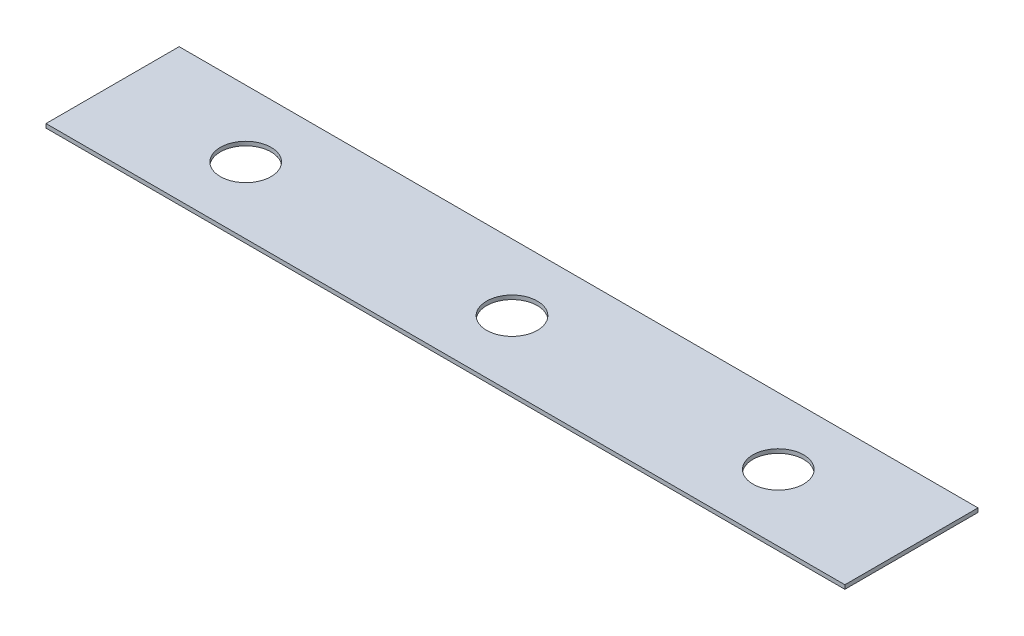
ISO-10303-21;
HEADER;
FILE_DESCRIPTION(('STEP AP214'),'2;1');
FILE_NAME('part.step','',(''),(''),'','','');
FILE_SCHEMA(('AUTOMOTIVE_DESIGN { 1 0 10303 214 1 1 1 1 }'));
ENDSEC;
DATA;
#1=APPLICATION_CONTEXT('core data for automotive mechanical design processes');
#2=APPLICATION_PROTOCOL_DEFINITION('international standard','automotive_design',2000,#1);
#3=PRODUCT_CONTEXT('',#1,'mechanical');
#4=PRODUCT('Part','Part','',(#3));
#5=PRODUCT_RELATED_PRODUCT_CATEGORY('part','',(#4));
#6=PRODUCT_DEFINITION_FORMATION('','',#4);
#7=PRODUCT_DEFINITION_CONTEXT('part definition',#1,'design');
#8=PRODUCT_DEFINITION('design','',#6,#7);
#9=PRODUCT_DEFINITION_SHAPE('','',#8);
#10=(LENGTH_UNIT() NAMED_UNIT(*) SI_UNIT(.MILLI.,.METRE.));
#11=(NAMED_UNIT(*) PLANE_ANGLE_UNIT() SI_UNIT($,.RADIAN.));
#12=(NAMED_UNIT(*) SI_UNIT($,.STERADIAN.) SOLID_ANGLE_UNIT());
#13=UNCERTAINTY_MEASURE_WITH_UNIT(LENGTH_MEASURE(1.E-05),#10,'distance_accuracy_value','');
#14=(GEOMETRIC_REPRESENTATION_CONTEXT(3) GLOBAL_UNCERTAINTY_ASSIGNED_CONTEXT((#13)) GLOBAL_UNIT_ASSIGNED_CONTEXT((#10,
#11,#12)) REPRESENTATION_CONTEXT('',''));
#15=CARTESIAN_POINT('',(0.,0.,0.));
#16=DIRECTION('',(0.,0.,1.));
#17=DIRECTION('',(1.,0.,0.));
#18=AXIS2_PLACEMENT_3D('',#15,#16,#17);
#19=CARTESIAN_POINT('',(38.1,0.381000000000006,-6.35));
#20=DIRECTION('',(-1.,0.,0.));
#21=DIRECTION('',(0.,0.,1.));
#22=AXIS2_PLACEMENT_3D('',#19,#20,#21);
#23=PLANE('',#22);
#24=DIRECTION('',(0.,0.,-1.));
#25=VECTOR('',#24,1.);
#26=CARTESIAN_POINT('',(38.1,0.,-6.35));
#27=LINE('',#26,#25);
#28=CARTESIAN_POINT('',(38.1,0.,6.35));
#29=VERTEX_POINT('',#28);
#30=CARTESIAN_POINT('',(38.1,0.,-6.35));
#31=VERTEX_POINT('',#30);
#32=EDGE_CURVE('E109',#29,#31,#27,.T.);
#33=ORIENTED_EDGE('',*,*,#32,.T.);
#34=DIRECTION('',(0.,-1.,0.));
#35=VECTOR('',#34,1.);
#36=CARTESIAN_POINT('',(38.1,0.381000000000006,-6.35));
#37=LINE('',#36,#35);
#38=CARTESIAN_POINT('',(38.1,0.381000000000006,-6.35));
#39=VERTEX_POINT('',#38);
#40=EDGE_CURVE('E13',#39,#31,#37,.T.);
#41=ORIENTED_EDGE('',*,*,#40,.F.);
#42=DIRECTION('',(0.,0.,-1.));
#43=VECTOR('',#42,1.);
#44=CARTESIAN_POINT('',(38.1,0.381000000000006,-6.35));
#45=LINE('',#44,#43);
#46=CARTESIAN_POINT('',(38.1,0.381000000000006,6.35));
#47=VERTEX_POINT('',#46);
#48=EDGE_CURVE('E97',#47,#39,#45,.T.);
#49=ORIENTED_EDGE('',*,*,#48,.F.);
#50=DIRECTION('',(0.,-1.,0.));
#51=VECTOR('',#50,1.);
#52=CARTESIAN_POINT('',(38.1,0.381000000000006,6.35));
#53=LINE('',#52,#51);
#54=EDGE_CURVE('E105',#47,#29,#53,.T.);
#55=ORIENTED_EDGE('',*,*,#54,.T.);
#56=EDGE_LOOP('',(#33,#41,#49,#55));
#57=FACE_BOUND('',#56,.T.);
#58=ADVANCED_FACE('F46',(#57),#23,.F.);
#59=CARTESIAN_POINT('',(-38.1,0.381000000000006,-6.35));
#60=DIRECTION('',(0.,0.,1.));
#61=DIRECTION('',(1.,0.,0.));
#62=AXIS2_PLACEMENT_3D('',#59,#60,#61);
#63=PLANE('',#62);
#64=DIRECTION('',(-1.,0.,0.));
#65=VECTOR('',#64,1.);
#66=CARTESIAN_POINT('',(-38.1,0.,-6.35));
#67=LINE('',#66,#65);
#68=CARTESIAN_POINT('',(-38.1,0.,-6.35));
#69=VERTEX_POINT('',#68);
#70=EDGE_CURVE('E101',#31,#69,#67,.T.);
#71=ORIENTED_EDGE('',*,*,#70,.T.);
#72=DIRECTION('',(0.,-1.,0.));
#73=VECTOR('',#72,1.);
#74=CARTESIAN_POINT('',(-38.1,0.381000000000006,-6.35));
#75=LINE('',#74,#73);
#76=CARTESIAN_POINT('',(-38.1,0.381000000000006,-6.35));
#77=VERTEX_POINT('',#76);
#78=EDGE_CURVE('E54',#77,#69,#75,.T.);
#79=ORIENTED_EDGE('',*,*,#78,.F.);
#80=DIRECTION('',(-1.,0.,0.));
#81=VECTOR('',#80,1.);
#82=CARTESIAN_POINT('',(-38.1,0.381000000000006,-6.35));
#83=LINE('',#82,#81);
#84=EDGE_CURVE('E92',#39,#77,#83,.T.);
#85=ORIENTED_EDGE('',*,*,#84,.F.);
#86=ORIENTED_EDGE('',*,*,#40,.T.);
#87=EDGE_LOOP('',(#71,#79,#85,#86));
#88=FACE_BOUND('',#87,.T.);
#89=ADVANCED_FACE('F100',(#88),#63,.F.);
#90=CARTESIAN_POINT('',(-38.1,0.381000000000006,-6.35));
#91=DIRECTION('',(1.,0.,0.));
#92=DIRECTION('',(0.,0.,-1.));
#93=AXIS2_PLACEMENT_3D('',#90,#91,#92);
#94=PLANE('',#93);
#95=DIRECTION('',(0.,0.,1.));
#96=VECTOR('',#95,1.);
#97=CARTESIAN_POINT('',(-38.1,0.,-6.35));
#98=LINE('',#97,#96);
#99=CARTESIAN_POINT('',(-38.1,0.,6.35));
#100=VERTEX_POINT('',#99);
#101=EDGE_CURVE('E79',#69,#100,#98,.T.);
#102=ORIENTED_EDGE('',*,*,#101,.T.);
#103=DIRECTION('',(0.,-1.,0.));
#104=VECTOR('',#103,1.);
#105=CARTESIAN_POINT('',(-38.1,0.381000000000006,6.35));
#106=LINE('',#105,#104);
#107=CARTESIAN_POINT('',(-38.1,0.381000000000006,6.35));
#108=VERTEX_POINT('',#107);
#109=EDGE_CURVE('E102',#108,#100,#106,.T.);
#110=ORIENTED_EDGE('',*,*,#109,.F.);
#111=DIRECTION('',(0.,0.,1.));
#112=VECTOR('',#111,1.);
#113=CARTESIAN_POINT('',(-38.1,0.381000000000006,-6.35));
#114=LINE('',#113,#112);
#115=EDGE_CURVE('E95',#77,#108,#114,.T.);
#116=ORIENTED_EDGE('',*,*,#115,.F.);
#117=ORIENTED_EDGE('',*,*,#78,.T.);
#118=EDGE_LOOP('',(#102,#110,#116,#117));
#119=FACE_BOUND('',#118,.T.);
#120=ADVANCED_FACE('F103',(#119),#94,.F.);
#121=CARTESIAN_POINT('',(-38.1,0.381000000000006,6.35));
#122=DIRECTION('',(0.,0.,-1.));
#123=DIRECTION('',(-1.,0.,0.));
#124=AXIS2_PLACEMENT_3D('',#121,#122,#123);
#125=PLANE('',#124);
#126=DIRECTION('',(1.,0.,0.));
#127=VECTOR('',#126,1.);
#128=CARTESIAN_POINT('',(-38.1,0.,6.35));
#129=LINE('',#128,#127);
#130=EDGE_CURVE('E85',#100,#29,#129,.T.);
#131=ORIENTED_EDGE('',*,*,#130,.T.);
#132=ORIENTED_EDGE('',*,*,#54,.F.);
#133=DIRECTION('',(1.,0.,0.));
#134=VECTOR('',#133,1.);
#135=CARTESIAN_POINT('',(-38.1,0.381000000000006,6.35));
#136=LINE('',#135,#134);
#137=EDGE_CURVE('E62',#108,#47,#136,.T.);
#138=ORIENTED_EDGE('',*,*,#137,.F.);
#139=ORIENTED_EDGE('',*,*,#109,.T.);
#140=EDGE_LOOP('',(#131,#132,#138,#139));
#141=FACE_BOUND('',#140,.T.);
#142=ADVANCED_FACE('F117',(#141),#125,.F.);
#143=CARTESIAN_POINT('',(0.,0.381000000000006,0.));
#144=DIRECTION('',(0.,1.,0.));
#145=DIRECTION('',(0.,0.,1.));
#146=AXIS2_PLACEMENT_3D('',#143,#144,#145);
#147=PLANE('',#146);
#148=CARTESIAN_POINT('',(25.4,0.381000000000006,0.));
#149=DIRECTION('',(0.,1.,0.));
#150=DIRECTION('',(0.,0.,1.));
#151=AXIS2_PLACEMENT_3D('',#148,#149,#150);
#152=CIRCLE('',#151,2.41935);
#153=CARTESIAN_POINT('',(25.4,0.381000000000006,2.41935));
#154=VERTEX_POINT('',#153);
#155=EDGE_CURVE('E135',#154,#154,#152,.T.);
#156=ORIENTED_EDGE('',*,*,#155,.F.);
#157=EDGE_LOOP('',(#156));
#158=FACE_BOUND('',#157,.T.);
#159=CARTESIAN_POINT('',(-25.4,0.381000000000006,0.));
#160=DIRECTION('',(0.,1.,0.));
#161=DIRECTION('',(0.,0.,1.));
#162=AXIS2_PLACEMENT_3D('',#159,#160,#161);
#163=CIRCLE('',#162,2.41935);
#164=CARTESIAN_POINT('',(-25.4,0.381000000000006,2.41935));
#165=VERTEX_POINT('',#164);
#166=EDGE_CURVE('E129',#165,#165,#163,.T.);
#167=ORIENTED_EDGE('',*,*,#166,.F.);
#168=EDGE_LOOP('',(#167));
#169=FACE_BOUND('',#168,.T.);
#170=CARTESIAN_POINT('',(0.,0.381000000000006,0.));
#171=DIRECTION('',(0.,1.,0.));
#172=DIRECTION('',(0.,0.,1.));
#173=AXIS2_PLACEMENT_3D('',#170,#171,#172);
#174=CIRCLE('',#173,2.41935);
#175=CARTESIAN_POINT('',(0.,0.381000000000006,2.41935));
#176=VERTEX_POINT('',#175);
#177=EDGE_CURVE('E123',#176,#176,#174,.T.);
#178=ORIENTED_EDGE('',*,*,#177,.F.);
#179=EDGE_LOOP('',(#178));
#180=FACE_BOUND('',#179,.T.);
#181=ORIENTED_EDGE('',*,*,#48,.T.);
#182=ORIENTED_EDGE('',*,*,#84,.T.);
#183=ORIENTED_EDGE('',*,*,#115,.T.);
#184=ORIENTED_EDGE('',*,*,#137,.T.);
#185=EDGE_LOOP('',(#181,#182,#183,#184));
#186=FACE_BOUND('',#185,.T.);
#187=ADVANCED_FACE('F93',(#158,#169,#180,#186),#147,.T.);
#188=CARTESIAN_POINT('',(0.,0.,0.));
#189=DIRECTION('',(0.,1.,0.));
#190=DIRECTION('',(0.,0.,1.));
#191=AXIS2_PLACEMENT_3D('',#188,#189,#190);
#192=PLANE('',#191);
#193=CARTESIAN_POINT('',(25.4,0.,0.));
#194=DIRECTION('',(0.,1.,0.));
#195=DIRECTION('',(0.,0.,1.));
#196=AXIS2_PLACEMENT_3D('',#193,#194,#195);
#197=CIRCLE('',#196,2.41935);
#198=CARTESIAN_POINT('',(25.4,0.,2.41935));
#199=VERTEX_POINT('',#198);
#200=EDGE_CURVE('E132',#199,#199,#197,.T.);
#201=ORIENTED_EDGE('',*,*,#200,.T.);
#202=EDGE_LOOP('',(#201));
#203=FACE_BOUND('',#202,.T.);
#204=CARTESIAN_POINT('',(-25.4,0.,0.));
#205=DIRECTION('',(0.,1.,0.));
#206=DIRECTION('',(0.,0.,1.));
#207=AXIS2_PLACEMENT_3D('',#204,#205,#206);
#208=CIRCLE('',#207,2.41935);
#209=CARTESIAN_POINT('',(-25.4,0.,2.41935));
#210=VERTEX_POINT('',#209);
#211=EDGE_CURVE('E126',#210,#210,#208,.T.);
#212=ORIENTED_EDGE('',*,*,#211,.T.);
#213=EDGE_LOOP('',(#212));
#214=FACE_BOUND('',#213,.T.);
#215=CARTESIAN_POINT('',(0.,0.,0.));
#216=DIRECTION('',(0.,1.,0.));
#217=DIRECTION('',(0.,0.,1.));
#218=AXIS2_PLACEMENT_3D('',#215,#216,#217);
#219=CIRCLE('',#218,2.41935);
#220=CARTESIAN_POINT('',(0.,0.,2.41935));
#221=VERTEX_POINT('',#220);
#222=EDGE_CURVE('E112',#221,#221,#219,.T.);
#223=ORIENTED_EDGE('',*,*,#222,.T.);
#224=EDGE_LOOP('',(#223));
#225=FACE_BOUND('',#224,.T.);
#226=ORIENTED_EDGE('',*,*,#32,.F.);
#227=ORIENTED_EDGE('',*,*,#130,.F.);
#228=ORIENTED_EDGE('',*,*,#101,.F.);
#229=ORIENTED_EDGE('',*,*,#70,.F.);
#230=EDGE_LOOP('',(#226,#227,#228,#229));
#231=FACE_BOUND('',#230,.T.);
#232=ADVANCED_FACE('F120',(#203,#214,#225,#231),#192,.F.);
#233=CARTESIAN_POINT('',(0.,0.,0.));
#234=DIRECTION('',(0.,1.,0.));
#235=DIRECTION('',(0.,0.,1.));
#236=AXIS2_PLACEMENT_3D('',#233,#234,#235);
#237=CYLINDRICAL_SURFACE('',#236,2.41935);
#238=ORIENTED_EDGE('',*,*,#222,.F.);
#239=EDGE_LOOP('',(#238));
#240=FACE_BOUND('',#239,.T.);
#241=ORIENTED_EDGE('',*,*,#177,.T.);
#242=EDGE_LOOP('',(#241));
#243=FACE_BOUND('',#242,.T.);
#244=ADVANCED_FACE('F157',(#240,#243),#237,.F.);
#245=CARTESIAN_POINT('',(-25.4,0.,0.));
#246=DIRECTION('',(0.,1.,0.));
#247=DIRECTION('',(0.,0.,1.));
#248=AXIS2_PLACEMENT_3D('',#245,#246,#247);
#249=CYLINDRICAL_SURFACE('',#248,2.41935);
#250=ORIENTED_EDGE('',*,*,#211,.F.);
#251=EDGE_LOOP('',(#250));
#252=FACE_BOUND('',#251,.T.);
#253=ORIENTED_EDGE('',*,*,#166,.T.);
#254=EDGE_LOOP('',(#253));
#255=FACE_BOUND('',#254,.T.);
#256=ADVANCED_FACE('F146',(#252,#255),#249,.F.);
#257=CARTESIAN_POINT('',(25.4,0.,0.));
#258=DIRECTION('',(0.,1.,0.));
#259=DIRECTION('',(0.,0.,1.));
#260=AXIS2_PLACEMENT_3D('',#257,#258,#259);
#261=CYLINDRICAL_SURFACE('',#260,2.41935);
#262=ORIENTED_EDGE('',*,*,#200,.F.);
#263=EDGE_LOOP('',(#262));
#264=FACE_BOUND('',#263,.T.);
#265=ORIENTED_EDGE('',*,*,#155,.T.);
#266=EDGE_LOOP('',(#265));
#267=FACE_BOUND('',#266,.T.);
#268=ADVANCED_FACE('F143',(#264,#267),#261,.F.);
#269=CLOSED_SHELL('',(#58,#89,#120,#142,#187,#232,#244,#256,#268));
#270=MANIFOLD_SOLID_BREP('B2',#269);
#271=ADVANCED_BREP_SHAPE_REPRESENTATION('',(#18,#270),#14);
#272=SHAPE_DEFINITION_REPRESENTATION(#9,#271);
ENDSEC;
END-ISO-10303-21;
